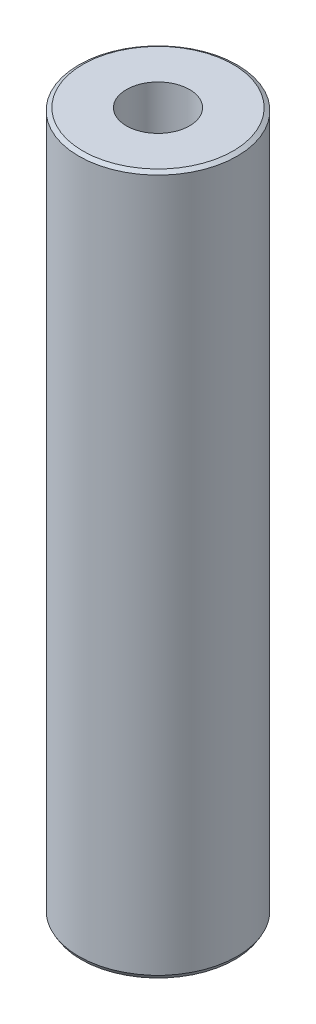
ISO-10303-21;
HEADER;
FILE_DESCRIPTION(('STEP AP214'),'2;1');
FILE_NAME('part.step','',(''),(''),'','','');
FILE_SCHEMA(('AUTOMOTIVE_DESIGN { 1 0 10303 214 1 1 1 1 }'));
ENDSEC;
DATA;
#1=APPLICATION_CONTEXT('core data for automotive mechanical design processes');
#2=APPLICATION_PROTOCOL_DEFINITION('international standard','automotive_design',2000,#1);
#3=PRODUCT_CONTEXT('',#1,'mechanical');
#4=PRODUCT('Part','Part','',(#3));
#5=PRODUCT_RELATED_PRODUCT_CATEGORY('part','',(#4));
#6=PRODUCT_DEFINITION_FORMATION('','',#4);
#7=PRODUCT_DEFINITION_CONTEXT('part definition',#1,'design');
#8=PRODUCT_DEFINITION('design','',#6,#7);
#9=PRODUCT_DEFINITION_SHAPE('','',#8);
#10=(LENGTH_UNIT() NAMED_UNIT(*) SI_UNIT(.MILLI.,.METRE.));
#11=(NAMED_UNIT(*) PLANE_ANGLE_UNIT() SI_UNIT($,.RADIAN.));
#12=(NAMED_UNIT(*) SI_UNIT($,.STERADIAN.) SOLID_ANGLE_UNIT());
#13=UNCERTAINTY_MEASURE_WITH_UNIT(LENGTH_MEASURE(1.E-05),#10,'distance_accuracy_value','');
#14=(GEOMETRIC_REPRESENTATION_CONTEXT(3) GLOBAL_UNCERTAINTY_ASSIGNED_CONTEXT((#13)) GLOBAL_UNIT_ASSIGNED_CONTEXT((#10,
#11,#12)) REPRESENTATION_CONTEXT('',''));
#15=CARTESIAN_POINT('',(0.,0.,0.));
#16=DIRECTION('',(0.,0.,1.));
#17=DIRECTION('',(1.,0.,0.));
#18=AXIS2_PLACEMENT_3D('',#15,#16,#17);
#19=CARTESIAN_POINT('',(0.,243.020051397425,0.));
#20=DIRECTION('',(0.,-1.,0.));
#21=DIRECTION('',(0.,0.,-1.));
#22=AXIS2_PLACEMENT_3D('',#19,#20,#21);
#23=CYLINDRICAL_SURFACE('',#22,27.5);
#24=CARTESIAN_POINT('',(0.,242.169110018277,0.));
#25=DIRECTION('',(0.,1.,0.));
#26=DIRECTION('',(0.,0.,1.));
#27=AXIS2_PLACEMENT_3D('',#24,#25,#26);
#28=CIRCLE('',#27,27.5);
#29=CARTESIAN_POINT('',(0.,242.169110018277,27.5));
#30=VERTEX_POINT('',#29);
#31=EDGE_CURVE('E50',#30,#30,#28,.F.);
#32=ORIENTED_EDGE('',*,*,#31,.T.);
#33=EDGE_LOOP('',(#32));
#34=FACE_BOUND('',#33,.T.);
#35=CARTESIAN_POINT('',(0.,1.41003843108947,0.));
#36=DIRECTION('',(0.,1.,0.));
#37=DIRECTION('',(0.,0.,1.));
#38=AXIS2_PLACEMENT_3D('',#35,#36,#37);
#39=CIRCLE('',#38,27.5);
#40=CARTESIAN_POINT('',(0.,1.41003843108947,27.5));
#41=VERTEX_POINT('',#40);
#42=EDGE_CURVE('E51',#41,#41,#39,.T.);
#43=ORIENTED_EDGE('',*,*,#42,.T.);
#44=EDGE_LOOP('',(#43));
#45=FACE_BOUND('',#44,.T.);
#46=ADVANCED_FACE('F39',(#34,#45),#23,.T.);
#47=CARTESIAN_POINT('',(0.,243.020051397425,0.));
#48=DIRECTION('',(0.,1.,0.));
#49=DIRECTION('',(0.,0.,1.));
#50=AXIS2_PLACEMENT_3D('',#47,#48,#49);
#51=PLANE('',#50);
#52=CARTESIAN_POINT('',(0.,243.020051397425,0.));
#53=DIRECTION('',(0.,1.,0.));
#54=DIRECTION('',(0.,0.,1.));
#55=AXIS2_PLACEMENT_3D('',#52,#53,#54);
#56=CIRCLE('',#55,26.0899615689105);
#57=CARTESIAN_POINT('',(0.,243.020051397425,26.0899615689105));
#58=VERTEX_POINT('',#57);
#59=EDGE_CURVE('E54',#58,#58,#56,.T.);
#60=ORIENTED_EDGE('',*,*,#59,.T.);
#61=EDGE_LOOP('',(#60));
#62=FACE_BOUND('',#61,.T.);
#63=CARTESIAN_POINT('',(0.,243.020051397425,0.));
#64=DIRECTION('',(0.,1.,0.));
#65=DIRECTION('',(0.,0.,1.));
#66=AXIS2_PLACEMENT_3D('',#63,#64,#65);
#67=CIRCLE('',#66,10.9569401527497);
#68=CARTESIAN_POINT('',(0.,243.020051397425,10.9569401527497));
#69=VERTEX_POINT('',#68);
#70=EDGE_CURVE('E58',#69,#69,#67,.T.);
#71=ORIENTED_EDGE('',*,*,#70,.F.);
#72=EDGE_LOOP('',(#71));
#73=FACE_BOUND('',#72,.T.);
#74=ADVANCED_FACE('F69',(#62,#73),#51,.T.);
#75=CARTESIAN_POINT('',(0.,0.,0.));
#76=DIRECTION('',(0.,1.,0.));
#77=DIRECTION('',(0.,0.,1.));
#78=AXIS2_PLACEMENT_3D('',#75,#76,#77);
#79=PLANE('',#78);
#80=CARTESIAN_POINT('',(0.,0.,0.));
#81=DIRECTION('',(0.,1.,0.));
#82=DIRECTION('',(0.,0.,1.));
#83=AXIS2_PLACEMENT_3D('',#80,#81,#82);
#84=CIRCLE('',#83,26.6490586208519);
#85=CARTESIAN_POINT('',(0.,0.,26.6490586208519));
#86=VERTEX_POINT('',#85);
#87=EDGE_CURVE('E10',#86,#86,#84,.F.);
#88=ORIENTED_EDGE('',*,*,#87,.T.);
#89=EDGE_LOOP('',(#88));
#90=FACE_BOUND('',#89,.T.);
#91=CARTESIAN_POINT('',(0.,0.,0.));
#92=DIRECTION('',(0.,1.,0.));
#93=DIRECTION('',(0.,0.,1.));
#94=AXIS2_PLACEMENT_3D('',#91,#92,#93);
#95=CIRCLE('',#94,10.9569401527497);
#96=CARTESIAN_POINT('',(0.,0.,10.9569401527497));
#97=VERTEX_POINT('',#96);
#98=EDGE_CURVE('E63',#97,#97,#95,.T.);
#99=ORIENTED_EDGE('',*,*,#98,.T.);
#100=EDGE_LOOP('',(#99));
#101=FACE_BOUND('',#100,.T.);
#102=ADVANCED_FACE('F75',(#90,#101),#79,.F.);
#103=CARTESIAN_POINT('',(0.,243.020051397425,0.));
#104=DIRECTION('',(0.,-1.,0.));
#105=DIRECTION('',(0.,0.,-1.));
#106=AXIS2_PLACEMENT_3D('',#103,#104,#105);
#107=CYLINDRICAL_SURFACE('',#106,10.9569401527497);
#108=ORIENTED_EDGE('',*,*,#70,.T.);
#109=EDGE_LOOP('',(#108));
#110=FACE_BOUND('',#109,.T.);
#111=ORIENTED_EDGE('',*,*,#98,.F.);
#112=EDGE_LOOP('',(#111));
#113=FACE_BOUND('',#112,.T.);
#114=ADVANCED_FACE('F70',(#110,#113),#107,.F.);
#115=CARTESIAN_POINT('',(0.,243.020051397425,0.));
#116=DIRECTION('',(0.,-1.,0.));
#117=DIRECTION('',(0.,0.,-1.));
#118=AXIS2_PLACEMENT_3D('',#115,#116,#117);
#119=CONICAL_SURFACE('',#118,26.0899615689105,1.02781601146718);
#120=ORIENTED_EDGE('',*,*,#31,.F.);
#121=EDGE_LOOP('',(#120));
#122=FACE_BOUND('',#121,.T.);
#123=ORIENTED_EDGE('',*,*,#59,.F.);
#124=EDGE_LOOP('',(#123));
#125=FACE_BOUND('',#124,.T.);
#126=ADVANCED_FACE('F81',(#122,#125),#119,.T.);
#127=CARTESIAN_POINT('',(0.,1.41003843108947,0.));
#128=DIRECTION('',(0.,1.,0.));
#129=DIRECTION('',(0.,0.,1.));
#130=AXIS2_PLACEMENT_3D('',#127,#128,#129);
#131=CONICAL_SURFACE('',#130,27.5,0.54298031532772);
#132=CARTESIAN_POINT('',(0.,0.,26.6490586208519));
#133=CARTESIAN_POINT('',(0.,0.0146879003238485,26.6579225935513));
#134=CARTESIAN_POINT('',(0.,0.0293758006476972,26.6667865662508));
#135=CARTESIAN_POINT('',(0.,0.0587516012953944,26.6845145116497));
#136=CARTESIAN_POINT('',(0.,0.073439501619243,26.6933784843492));
#137=CARTESIAN_POINT('',(0.,0.102815302266941,26.7111064297481));
#138=CARTESIAN_POINT('',(0.,0.117503202590789,26.7199704024476));
#139=CARTESIAN_POINT('',(0.,0.146879003238487,26.7376983478465));
#140=CARTESIAN_POINT('',(0.,0.161566903562335,26.7465623205459));
#141=CARTESIAN_POINT('',(0.,0.190942704210032,26.7642902659449));
#142=CARTESIAN_POINT('',(0.,0.205630604533881,26.7731542386443));
#143=CARTESIAN_POINT('',(0.,0.235006405181579,26.7908821840432));
#144=CARTESIAN_POINT('',(0.,0.249694305505427,26.7997461567427));
#145=CARTESIAN_POINT('',(0.,0.279070106153124,26.8174741021416));
#146=CARTESIAN_POINT('',(0.,0.293758006476973,26.8263380748411));
#147=CARTESIAN_POINT('',(0.,0.323133807124671,26.84406602024));
#148=CARTESIAN_POINT('',(0.,0.337821707448519,26.8529299929395));
#149=CARTESIAN_POINT('',(0.,0.367197508096217,26.8706579383384));
#150=CARTESIAN_POINT('',(0.,0.381885408420065,26.8795219110378));
#151=CARTESIAN_POINT('',(0.,0.411261209067762,26.8972498564368));
#152=CARTESIAN_POINT('',(0.,0.425949109391611,26.9061138291362));
#153=CARTESIAN_POINT('',(0.,0.455324910039308,26.9238417745351));
#154=CARTESIAN_POINT('',(0.,0.470012810363157,26.9327057472346));
#155=CARTESIAN_POINT('',(0.,0.499388611010854,26.9504336926335));
#156=CARTESIAN_POINT('',(0.,0.514076511334703,26.959297665333));
#157=CARTESIAN_POINT('',(0.,0.543452311982401,26.9770256107319));
#158=CARTESIAN_POINT('',(0.,0.558140212306249,26.9858895834313));
#159=CARTESIAN_POINT('',(0.,0.587516012953947,27.0036175288303));
#160=CARTESIAN_POINT('',(0.,0.602203913277795,27.0124815015297));
#161=CARTESIAN_POINT('',(0.,0.631579713925492,27.0302094469287));
#162=CARTESIAN_POINT('',(0.,0.646267614249341,27.0390734196281));
#163=CARTESIAN_POINT('',(0.,0.675643414897039,27.056801365027));
#164=CARTESIAN_POINT('',(0.,0.690331315220887,27.0656653377265));
#165=CARTESIAN_POINT('',(0.,0.719707115868584,27.0833932831254));
#166=CARTESIAN_POINT('',(0.,0.734395016192433,27.0922572558249));
#167=CARTESIAN_POINT('',(0.,0.76377081684013,27.1099852012238));
#168=CARTESIAN_POINT('',(0.,0.778458717163979,27.1188491739232));
#169=CARTESIAN_POINT('',(0.,0.807834517811677,27.1365771193222));
#170=CARTESIAN_POINT('',(0.,0.822522418135525,27.1454410920216));
#171=CARTESIAN_POINT('',(0.,0.851898218783223,27.1631690374205));
#172=CARTESIAN_POINT('',(0.,0.866586119107071,27.17203301012));
#173=CARTESIAN_POINT('',(0.,0.895961919754768,27.1897609555189));
#174=CARTESIAN_POINT('',(0.,0.910649820078617,27.1986249282184));
#175=CARTESIAN_POINT('',(0.,0.940025620726315,27.2163528736173));
#176=CARTESIAN_POINT('',(0.,0.954713521050163,27.2252168463168));
#177=CARTESIAN_POINT('',(0.,0.98408932169786,27.2429447917157));
#178=CARTESIAN_POINT('',(0.,0.998777222021709,27.2518087644151));
#179=CARTESIAN_POINT('',(0.,1.02815302266941,27.2695367098141));
#180=CARTESIAN_POINT('',(0.,1.04284092299326,27.2784006825135));
#181=CARTESIAN_POINT('',(0.,1.07221672364095,27.2961286279124));
#182=CARTESIAN_POINT('',(0.,1.0869046239648,27.3049926006119));
#183=CARTESIAN_POINT('',(0.,1.1162804246125,27.3227205460108));
#184=CARTESIAN_POINT('',(0.,1.13096832493635,27.3315845187103));
#185=CARTESIAN_POINT('',(0.,1.16034412558404,27.3493124641092));
#186=CARTESIAN_POINT('',(0.,1.17503202590789,27.3581764368086));
#187=CARTESIAN_POINT('',(0.,1.20440782655559,27.3759043822076));
#188=CARTESIAN_POINT('',(0.,1.21909572687944,27.384768354907));
#189=CARTESIAN_POINT('',(0.,1.24847152752714,27.4024963003059));
#190=CARTESIAN_POINT('',(0.,1.26315942785099,27.4113602730054));
#191=CARTESIAN_POINT('',(0.,1.29253522849868,27.4290882184043));
#192=CARTESIAN_POINT('',(0.,1.30722312882253,27.4379521911038));
#193=CARTESIAN_POINT('',(0.,1.33659892947023,27.4556801365027));
#194=CARTESIAN_POINT('',(0.,1.35128682979408,27.4645441092022));
#195=CARTESIAN_POINT('',(0.,1.38066263044177,27.4822720546011));
#196=CARTESIAN_POINT('',(0.,1.39535053076562,27.4911360273005));
#197=CARTESIAN_POINT('',(0.,1.41003843108947,27.5));
#198=B_SPLINE_CURVE_WITH_KNOTS('',3,(#132,#133,#134,#135,#136,#137,#138,#139,#140,#141,#142,
#143,#144,#145,#146,#147,#148,#149,#150,#151,#152,#153,#154,#155,#156,#157,#158,#159,#160,#161,
#162,#163,#164,#165,#166,#167,#168,#169,#170,#171,#172,#173,#174,#175,#176,#177,#178,#179,#180,
#181,#182,#183,#184,#185,#186,#187,#188,#189,#190,#191,#192,#193,#194,#195,#196,#197),
.UNSPECIFIED.,.F.,.F.,(4,2,2,2,2,2,2,2,2,2,2,2,2,2,2,2,2,2,2,2,2,2,2,2,2,2,2,2,2,2,2,2,4),(0.,
0.051465909604909,0.102931819209818,0.154397728814727,0.205863638419638,0.257329548024547,
0.308795457629456,0.360261367234365,0.411727276839274,0.463193186444185,0.514659096049094,
0.566125005654003,0.617590915258912,0.669056824863821,0.720522734468732,0.771988644073641,
0.82345455367855,0.874920463283459,0.926386372888368,0.977852282493277,1.02931819209819,
1.0807841017031,1.13225001130801,1.18371592091292,1.23518183051782,1.28664774012273,
1.33811364972764,1.38957955933255,1.44104546893746,1.49251137854237,1.54397728814728,
1.59544319775219,1.6469091073571),.UNSPECIFIED.);
#199=EDGE_CURVE('BSEAM45',#86,#41,#198,.T.);
#200=ORIENTED_EDGE('',*,*,#87,.F.);
#201=ORIENTED_EDGE('',*,*,#42,.F.);
#202=ORIENTED_EDGE('',*,*,#199,.T.);
#203=ORIENTED_EDGE('',*,*,#199,.F.);
#204=EDGE_LOOP('',(#200,#202,#201,#203));
#205=FACE_BOUND('',#204,.T.);
#206=ADVANCED_FACE('F45',(#205),#131,.T.);
#207=CLOSED_SHELL('',(#46,#74,#102,#114,#126,#206));
#208=MANIFOLD_SOLID_BREP('B2',#207);
#209=ADVANCED_BREP_SHAPE_REPRESENTATION('',(#18,#208),#14);
#210=SHAPE_DEFINITION_REPRESENTATION(#9,#209);
ENDSEC;
END-ISO-10303-21;
